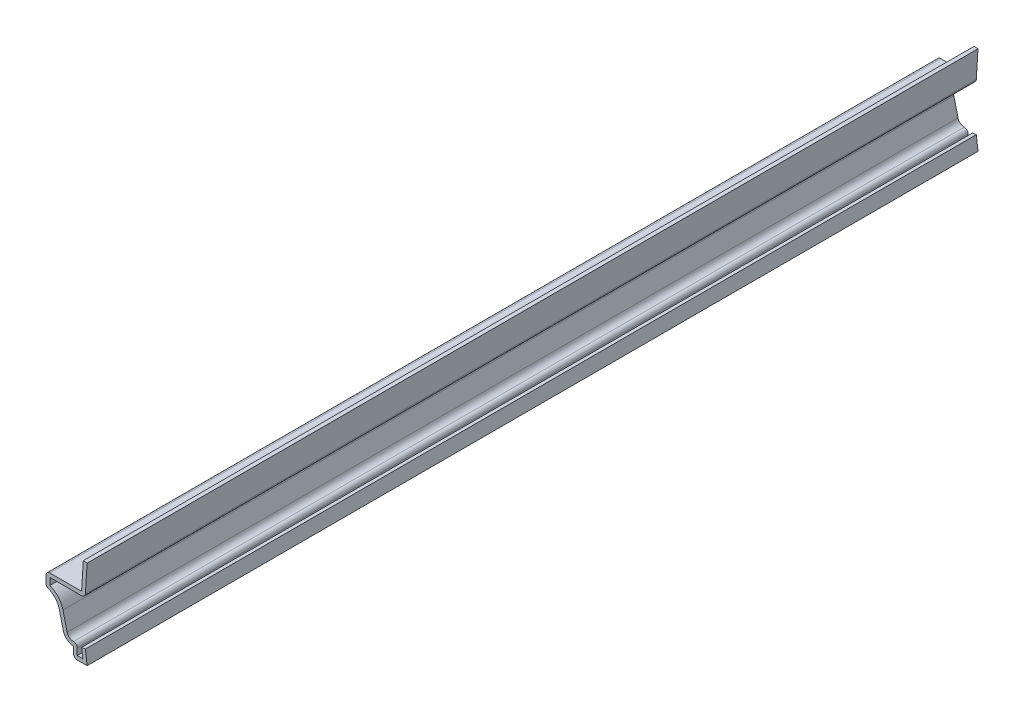
ISO-10303-21;
HEADER;
FILE_DESCRIPTION(('STEP AP214'),'2;1');
FILE_NAME('part.step','',(''),(''),'','','');
FILE_SCHEMA(('AUTOMOTIVE_DESIGN { 1 0 10303 214 1 1 1 1 }'));
ENDSEC;
DATA;
#1=APPLICATION_CONTEXT('core data for automotive mechanical design processes');
#2=APPLICATION_PROTOCOL_DEFINITION('international standard','automotive_design',2000,#1);
#3=PRODUCT_CONTEXT('',#1,'mechanical');
#4=PRODUCT('Part','Part','',(#3));
#5=PRODUCT_RELATED_PRODUCT_CATEGORY('part','',(#4));
#6=PRODUCT_DEFINITION_FORMATION('','',#4);
#7=PRODUCT_DEFINITION_CONTEXT('part definition',#1,'design');
#8=PRODUCT_DEFINITION('design','',#6,#7);
#9=PRODUCT_DEFINITION_SHAPE('','',#8);
#10=(LENGTH_UNIT() NAMED_UNIT(*) SI_UNIT(.MILLI.,.METRE.));
#11=(NAMED_UNIT(*) PLANE_ANGLE_UNIT() SI_UNIT($,.RADIAN.));
#12=(NAMED_UNIT(*) SI_UNIT($,.STERADIAN.) SOLID_ANGLE_UNIT());
#13=UNCERTAINTY_MEASURE_WITH_UNIT(LENGTH_MEASURE(1.E-05),#10,'distance_accuracy_value','');
#14=(GEOMETRIC_REPRESENTATION_CONTEXT(3) GLOBAL_UNCERTAINTY_ASSIGNED_CONTEXT((#13)) GLOBAL_UNIT_ASSIGNED_CONTEXT((#10,
#11,#12)) REPRESENTATION_CONTEXT('',''));
#15=CARTESIAN_POINT('',(0.,0.,0.));
#16=DIRECTION('',(0.,0.,1.));
#17=DIRECTION('',(1.,0.,0.));
#18=AXIS2_PLACEMENT_3D('',#15,#16,#17);
#19=CARTESIAN_POINT('',(0.,0.,-206.375));
#20=DIRECTION('',(0.992156741649221,0.125,0.));
#21=DIRECTION('',(-0.125,0.992156741649222,0.));
#22=AXIS2_PLACEMENT_3D('',#19,#20,#21);
#23=PLANE('',#22);
#24=DIRECTION('',(-0.125,0.992156741649221,0.));
#25=VECTOR('',#24,1.);
#26=CARTESIAN_POINT('',(0.,0.,0.));
#27=LINE('',#26,#25);
#28=CARTESIAN_POINT('',(0.,0.,0.));
#29=VERTEX_POINT('',#28);
#30=CARTESIAN_POINT('',(-0.396875,3.15009765473628,0.));
#31=VERTEX_POINT('',#30);
#32=EDGE_CURVE('E274',#29,#31,#27,.T.);
#33=ORIENTED_EDGE('',*,*,#32,.F.);
#34=DIRECTION('',(0.,0.,1.));
#35=VECTOR('',#34,1.);
#36=CARTESIAN_POINT('',(0.,0.,-206.375));
#37=LINE('',#36,#35);
#38=CARTESIAN_POINT('',(0.,0.,-206.375));
#39=VERTEX_POINT('',#38);
#40=EDGE_CURVE('E227',#39,#29,#37,.T.);
#41=ORIENTED_EDGE('',*,*,#40,.F.);
#42=DIRECTION('',(-0.125,0.992156741649221,0.));
#43=VECTOR('',#42,1.);
#44=CARTESIAN_POINT('',(0.,0.,-206.375));
#45=LINE('',#44,#43);
#46=CARTESIAN_POINT('',(-0.396875,3.15009765473628,-206.375));
#47=VERTEX_POINT('',#46);
#48=EDGE_CURVE('E207',#39,#47,#45,.T.);
#49=ORIENTED_EDGE('',*,*,#48,.T.);
#50=DIRECTION('',(0.,0.,1.));
#51=VECTOR('',#50,1.);
#52=CARTESIAN_POINT('',(-0.396875,3.15009765473628,-206.375));
#53=LINE('',#52,#51);
#54=EDGE_CURVE('E215',#47,#31,#53,.T.);
#55=ORIENTED_EDGE('',*,*,#54,.T.);
#56=EDGE_LOOP('',(#33,#41,#49,#55));
#57=FACE_BOUND('',#56,.T.);
#58=ADVANCED_FACE('F35',(#57),#23,.T.);
#59=CARTESIAN_POINT('',(-3.175,0.,-206.375));
#60=DIRECTION('',(0.,-1.,0.));
#61=DIRECTION('',(0.,0.,-1.));
#62=AXIS2_PLACEMENT_3D('',#59,#60,#61);
#63=PLANE('',#62);
#64=DIRECTION('',(1.,0.,0.));
#65=VECTOR('',#64,1.);
#66=CARTESIAN_POINT('',(-3.175,0.,0.));
#67=LINE('',#66,#65);
#68=CARTESIAN_POINT('',(-2.286,0.,0.));
#69=VERTEX_POINT('',#68);
#70=EDGE_CURVE('E228',#69,#29,#67,.T.);
#71=ORIENTED_EDGE('',*,*,#70,.F.);
#72=DIRECTION('',(0.,0.,1.));
#73=VECTOR('',#72,1.);
#74=CARTESIAN_POINT('',(-2.286,0.,-206.375));
#75=LINE('',#74,#73);
#76=CARTESIAN_POINT('',(-2.286,0.,-206.375));
#77=VERTEX_POINT('',#76);
#78=EDGE_CURVE('E364',#69,#77,#75,.F.);
#79=ORIENTED_EDGE('',*,*,#78,.T.);
#80=DIRECTION('',(1.,0.,0.));
#81=VECTOR('',#80,1.);
#82=CARTESIAN_POINT('',(-3.175,0.,-206.375));
#83=LINE('',#82,#81);
#84=EDGE_CURVE('E223',#77,#39,#83,.T.);
#85=ORIENTED_EDGE('',*,*,#84,.T.);
#86=ORIENTED_EDGE('',*,*,#40,.T.);
#87=EDGE_LOOP('',(#71,#79,#85,#86));
#88=FACE_BOUND('',#87,.T.);
#89=ADVANCED_FACE('F467',(#88),#63,.T.);
#90=CARTESIAN_POINT('',(-3.175,2.38125,-206.375));
#91=DIRECTION('',(-1.,0.,0.));
#92=DIRECTION('',(0.,0.,1.));
#93=AXIS2_PLACEMENT_3D('',#90,#91,#92);
#94=PLANE('',#93);
#95=DIRECTION('',(0.,-1.,0.));
#96=VECTOR('',#95,1.);
#97=CARTESIAN_POINT('',(-3.175,2.38125,-206.375));
#98=LINE('',#97,#96);
#99=CARTESIAN_POINT('',(-3.175,2.38125,-206.375));
#100=VERTEX_POINT('',#99);
#101=CARTESIAN_POINT('',(-3.175,0.889,-206.375));
#102=VERTEX_POINT('',#101);
#103=EDGE_CURVE('E270',#100,#102,#98,.T.);
#104=ORIENTED_EDGE('',*,*,#103,.T.);
#105=DIRECTION('',(0.,0.,1.));
#106=VECTOR('',#105,1.);
#107=CARTESIAN_POINT('',(-3.175,0.889,-206.375));
#108=LINE('',#107,#106);
#109=CARTESIAN_POINT('',(-3.175,0.889,0.));
#110=VERTEX_POINT('',#109);
#111=EDGE_CURVE('E318',#102,#110,#108,.T.);
#112=ORIENTED_EDGE('',*,*,#111,.T.);
#113=DIRECTION('',(0.,-1.,0.));
#114=VECTOR('',#113,1.);
#115=CARTESIAN_POINT('',(-3.175,2.38125,0.));
#116=LINE('',#115,#114);
#117=CARTESIAN_POINT('',(-3.175,2.38125,0.));
#118=VERTEX_POINT('',#117);
#119=EDGE_CURVE('E230',#118,#110,#116,.T.);
#120=ORIENTED_EDGE('',*,*,#119,.F.);
#121=DIRECTION('',(0.,0.,1.));
#122=VECTOR('',#121,1.);
#123=CARTESIAN_POINT('',(-3.175,2.38125,-206.375));
#124=LINE('',#123,#122);
#125=EDGE_CURVE('E319',#100,#118,#124,.T.);
#126=ORIENTED_EDGE('',*,*,#125,.F.);
#127=EDGE_LOOP('',(#104,#112,#120,#126));
#128=FACE_BOUND('',#127,.T.);
#129=ADVANCED_FACE('F459',(#128),#94,.T.);
#130=CARTESIAN_POINT('',(-3.175,4.7625,-206.375));
#131=DIRECTION('',(0.,0.,1.));
#132=DIRECTION('',(1.,0.,0.));
#133=AXIS2_PLACEMENT_3D('',#130,#131,#132);
#134=CYLINDRICAL_SURFACE('',#133,2.38125);
#135=CARTESIAN_POINT('',(-3.175,4.7625,0.));
#136=DIRECTION('',(0.,0.,1.));
#137=DIRECTION('',(1.,0.,0.));
#138=AXIS2_PLACEMENT_3D('',#135,#136,#137);
#139=CIRCLE('',#138,2.38125);
#140=CARTESIAN_POINT('',(-5.48745718700354,4.19426297130892,0.));
#141=VERTEX_POINT('',#140);
#142=EDGE_CURVE('E312',#141,#118,#139,.T.);
#143=ORIENTED_EDGE('',*,*,#142,.F.);
#144=DIRECTION('',(0.,0.,1.));
#145=VECTOR('',#144,1.);
#146=CARTESIAN_POINT('',(-5.48745718700354,4.19426297130892,-206.375));
#147=LINE('',#146,#145);
#148=CARTESIAN_POINT('',(-5.48745718700354,4.19426297130892,-206.375));
#149=VERTEX_POINT('',#148);
#150=EDGE_CURVE('E321',#149,#141,#147,.T.);
#151=ORIENTED_EDGE('',*,*,#150,.F.);
#152=CARTESIAN_POINT('',(-3.175,4.7625,-206.375));
#153=DIRECTION('',(0.,0.,1.));
#154=DIRECTION('',(1.,0.,0.));
#155=AXIS2_PLACEMENT_3D('',#152,#153,#154);
#156=CIRCLE('',#155,2.38125);
#157=EDGE_CURVE('E267',#149,#100,#156,.T.);
#158=ORIENTED_EDGE('',*,*,#157,.T.);
#159=ORIENTED_EDGE('',*,*,#125,.T.);
#160=EDGE_LOOP('',(#143,#151,#158,#159));
#161=FACE_BOUND('',#160,.T.);
#162=ADVANCED_FACE('F455',(#161),#134,.T.);
#163=CARTESIAN_POINT('',(-6.46465468832743,8.17099674781684,-206.375));
#164=DIRECTION('',(-0.971110629712773,-0.238629723334838,0.));
#165=DIRECTION('',(0.238629723334838,-0.971110629712773,0.));
#166=AXIS2_PLACEMENT_3D('',#163,#164,#165);
#167=PLANE('',#166);
#168=DIRECTION('',(0.238629723334838,-0.971110629712773,0.));
#169=VECTOR('',#168,1.);
#170=CARTESIAN_POINT('',(-6.46465468832743,8.17099674781684,0.));
#171=LINE('',#170,#169);
#172=CARTESIAN_POINT('',(-6.46465468832743,8.17099674781684,0.));
#173=VERTEX_POINT('',#172);
#174=EDGE_CURVE('E309',#173,#141,#171,.T.);
#175=ORIENTED_EDGE('',*,*,#174,.F.);
#176=DIRECTION('',(0.,0.,1.));
#177=VECTOR('',#176,1.);
#178=CARTESIAN_POINT('',(-6.46465468832743,8.17099674781684,-206.375));
#179=LINE('',#178,#177);
#180=CARTESIAN_POINT('',(-6.46465468832743,8.17099674781684,-206.375));
#181=VERTEX_POINT('',#180);
#182=EDGE_CURVE('E323',#181,#173,#179,.T.);
#183=ORIENTED_EDGE('',*,*,#182,.F.);
#184=DIRECTION('',(0.238629723334838,-0.971110629712773,0.));
#185=VECTOR('',#184,1.);
#186=CARTESIAN_POINT('',(-6.46465468832743,8.17099674781684,-206.375));
#187=LINE('',#186,#185);
#188=EDGE_CURVE('E264',#181,#149,#187,.T.);
#189=ORIENTED_EDGE('',*,*,#188,.T.);
#190=ORIENTED_EDGE('',*,*,#150,.T.);
#191=EDGE_LOOP('',(#175,#183,#189,#190));
#192=FACE_BOUND('',#191,.T.);
#193=ADVANCED_FACE('F451',(#192),#167,.T.);
#194=CARTESIAN_POINT('',(-10.31875,7.2239350333317,-206.375));
#195=DIRECTION('',(0.,0.,1.));
#196=DIRECTION('',(1.,0.,0.));
#197=AXIS2_PLACEMENT_3D('',#194,#195,#196);
#198=CYLINDRICAL_SURFACE('',#197,3.96875);
#199=CARTESIAN_POINT('',(-10.31875,7.2239350333317,0.));
#200=DIRECTION('',(0.,0.,-1.));
#201=DIRECTION('',(-1.,0.,0.));
#202=AXIS2_PLACEMENT_3D('',#199,#200,#201);
#203=CIRCLE('',#202,3.96875);
#204=CARTESIAN_POINT('',(-8.94395424836602,10.9469597718728,0.));
#205=VERTEX_POINT('',#204);
#206=EDGE_CURVE('E307',#205,#173,#203,.T.);
#207=ORIENTED_EDGE('',*,*,#206,.F.);
#208=DIRECTION('',(0.,0.,1.));
#209=VECTOR('',#208,1.);
#210=CARTESIAN_POINT('',(-8.94395424836602,10.9469597718728,-206.375));
#211=LINE('',#210,#209);
#212=CARTESIAN_POINT('',(-8.94395424836602,10.9469597718728,-206.375));
#213=VERTEX_POINT('',#212);
#214=EDGE_CURVE('E384',#205,#213,#211,.F.);
#215=ORIENTED_EDGE('',*,*,#214,.T.);
#216=CARTESIAN_POINT('',(-10.31875,7.2239350333317,-206.375));
#217=DIRECTION('',(0.,0.,-1.));
#218=DIRECTION('',(-1.,0.,0.));
#219=AXIS2_PLACEMENT_3D('',#216,#217,#218);
#220=CIRCLE('',#219,3.96875);
#221=EDGE_CURVE('E262',#213,#181,#220,.T.);
#222=ORIENTED_EDGE('',*,*,#221,.T.);
#223=ORIENTED_EDGE('',*,*,#182,.T.);
#224=EDGE_LOOP('',(#207,#215,#222,#223));
#225=FACE_BOUND('',#224,.T.);
#226=ADVANCED_FACE('F446',(#225),#198,.F.);
#227=CARTESIAN_POINT('',(-9.525,14.2875,-206.375));
#228=DIRECTION('',(-1.,0.,0.));
#229=DIRECTION('',(0.,-1.,0.));
#230=AXIS2_PLACEMENT_3D('',#227,#228,#229);
#231=PLANE('',#230);
#232=DIRECTION('',(0.,-1.,0.));
#233=VECTOR('',#232,1.);
#234=CARTESIAN_POINT('',(-9.525,14.2875,-206.375));
#235=LINE('',#234,#233);
#236=CARTESIAN_POINT('',(-9.525,13.3985,-206.375));
#237=VERTEX_POINT('',#236);
#238=CARTESIAN_POINT('',(-9.525,11.780917313306,-206.375));
#239=VERTEX_POINT('',#238);
#240=EDGE_CURVE('E259',#237,#239,#235,.T.);
#241=ORIENTED_EDGE('',*,*,#240,.T.);
#242=DIRECTION('',(0.,0.,1.));
#243=VECTOR('',#242,1.);
#244=CARTESIAN_POINT('',(-9.525,11.780917313306,-206.375));
#245=LINE('',#244,#243);
#246=CARTESIAN_POINT('',(-9.525,11.780917313306,0.));
#247=VERTEX_POINT('',#246);
#248=EDGE_CURVE('E381',#239,#247,#245,.T.);
#249=ORIENTED_EDGE('',*,*,#248,.T.);
#250=DIRECTION('',(0.,-1.,0.));
#251=VECTOR('',#250,1.);
#252=CARTESIAN_POINT('',(-9.525,14.2875,0.));
#253=LINE('',#252,#251);
#254=CARTESIAN_POINT('',(-9.525,13.3985,0.));
#255=VERTEX_POINT('',#254);
#256=EDGE_CURVE('E304',#255,#247,#253,.T.);
#257=ORIENTED_EDGE('',*,*,#256,.F.);
#258=DIRECTION('',(0.,0.,1.));
#259=VECTOR('',#258,1.);
#260=CARTESIAN_POINT('',(-9.525,13.3985,-206.375));
#261=LINE('',#260,#259);
#262=EDGE_CURVE('E379',#255,#237,#261,.F.);
#263=ORIENTED_EDGE('',*,*,#262,.T.);
#264=EDGE_LOOP('',(#241,#249,#257,#263));
#265=FACE_BOUND('',#264,.T.);
#266=ADVANCED_FACE('F434',(#265),#231,.T.);
#267=CARTESIAN_POINT('',(-1.28414374227129,14.2875,-206.375));
#268=DIRECTION('',(0.,1.,0.));
#269=DIRECTION('',(0.,0.,1.));
#270=AXIS2_PLACEMENT_3D('',#267,#268,#269);
#271=PLANE('',#270);
#272=DIRECTION('',(-1.,0.,0.));
#273=VECTOR('',#272,1.);
#274=CARTESIAN_POINT('',(-1.28414374227129,14.2875,-206.375));
#275=LINE('',#274,#273);
#276=CARTESIAN_POINT('',(-1.28414374227129,14.2875,-206.375));
#277=VERTEX_POINT('',#276);
#278=CARTESIAN_POINT('',(-8.636,14.2875,-206.375));
#279=VERTEX_POINT('',#278);
#280=EDGE_CURVE('E256',#277,#279,#275,.T.);
#281=ORIENTED_EDGE('',*,*,#280,.T.);
#282=DIRECTION('',(0.,0.,1.));
#283=VECTOR('',#282,1.);
#284=CARTESIAN_POINT('',(-8.636,14.2875,-206.375));
#285=LINE('',#284,#283);
#286=CARTESIAN_POINT('',(-8.636,14.2875,0.));
#287=VERTEX_POINT('',#286);
#288=EDGE_CURVE('E386',#279,#287,#285,.T.);
#289=ORIENTED_EDGE('',*,*,#288,.T.);
#290=DIRECTION('',(-1.,0.,0.));
#291=VECTOR('',#290,1.);
#292=CARTESIAN_POINT('',(-1.28414374227129,14.2875,0.));
#293=LINE('',#292,#291);
#294=CARTESIAN_POINT('',(-1.28414374227129,14.2875,0.));
#295=VERTEX_POINT('',#294);
#296=EDGE_CURVE('E301',#295,#287,#293,.T.);
#297=ORIENTED_EDGE('',*,*,#296,.F.);
#298=DIRECTION('',(0.,0.,1.));
#299=VECTOR('',#298,1.);
#300=CARTESIAN_POINT('',(-1.28414374227129,14.2875,-206.375));
#301=LINE('',#300,#299);
#302=EDGE_CURVE('E326',#277,#295,#301,.T.);
#303=ORIENTED_EDGE('',*,*,#302,.F.);
#304=EDGE_LOOP('',(#281,#289,#297,#303));
#305=FACE_BOUND('',#304,.T.);
#306=ADVANCED_FACE('F428',(#305),#271,.T.);
#307=CARTESIAN_POINT('',(-0.887268742271285,20.6375,-206.375));
#308=DIRECTION('',(-0.998052578482889,0.0623782861551807,0.));
#309=DIRECTION('',(-0.0623782861551807,-0.998052578482889,0.));
#310=AXIS2_PLACEMENT_3D('',#307,#308,#309);
#311=PLANE('',#310);
#312=DIRECTION('',(-0.0623782861551807,-0.998052578482889,0.));
#313=VECTOR('',#312,1.);
#314=CARTESIAN_POINT('',(-0.887268742271285,20.6375,0.));
#315=LINE('',#314,#313);
#316=CARTESIAN_POINT('',(-0.887268742271285,20.6375,0.));
#317=VERTEX_POINT('',#316);
#318=EDGE_CURVE('E298',#317,#295,#315,.T.);
#319=ORIENTED_EDGE('',*,*,#318,.F.);
#320=DIRECTION('',(0.,0.,1.));
#321=VECTOR('',#320,1.);
#322=CARTESIAN_POINT('',(-0.887268742271285,20.6375,-206.375));
#323=LINE('',#322,#321);
#324=CARTESIAN_POINT('',(-0.887268742271285,20.6375,-206.375));
#325=VERTEX_POINT('',#324);
#326=EDGE_CURVE('E328',#325,#317,#323,.T.);
#327=ORIENTED_EDGE('',*,*,#326,.F.);
#328=DIRECTION('',(-0.0623782861551807,-0.998052578482889,0.));
#329=VECTOR('',#328,1.);
#330=CARTESIAN_POINT('',(-0.887268742271285,20.6375,-206.375));
#331=LINE('',#330,#329);
#332=EDGE_CURVE('E253',#325,#277,#331,.T.);
#333=ORIENTED_EDGE('',*,*,#332,.T.);
#334=ORIENTED_EDGE('',*,*,#302,.T.);
#335=EDGE_LOOP('',(#319,#327,#333,#334));
#336=FACE_BOUND('',#335,.T.);
#337=ADVANCED_FACE('F422',(#336),#311,.T.);
#338=CARTESIAN_POINT('',(-0.887268742271285,20.6375,-206.375));
#339=DIRECTION('',(-0.0623782861551812,-0.998052578482889,0.));
#340=DIRECTION('',(0.998052578482889,-0.0623782861551812,0.));
#341=AXIS2_PLACEMENT_3D('',#338,#339,#340);
#342=PLANE('',#341);
#343=DIRECTION('',(0.998052578482889,-0.0623782861551811,0.));
#344=VECTOR('',#343,1.);
#345=CARTESIAN_POINT('',(-0.887268742271285,20.6375,0.));
#346=LINE('',#345,#344);
#347=CARTESIAN_POINT('',(0.,20.582045703608,0.));
#348=VERTEX_POINT('',#347);
#349=EDGE_CURVE('E296',#317,#348,#346,.T.);
#350=ORIENTED_EDGE('',*,*,#349,.T.);
#351=DIRECTION('',(0.,0.,1.));
#352=VECTOR('',#351,1.);
#353=CARTESIAN_POINT('',(0.,20.582045703608,-206.375));
#354=LINE('',#353,#352);
#355=CARTESIAN_POINT('',(0.,20.582045703608,-206.375));
#356=VERTEX_POINT('',#355);
#357=EDGE_CURVE('E330',#356,#348,#354,.T.);
#358=ORIENTED_EDGE('',*,*,#357,.F.);
#359=DIRECTION('',(0.998052578482889,-0.0623782861551811,0.));
#360=VECTOR('',#359,1.);
#361=CARTESIAN_POINT('',(-0.887268742271285,20.6375,-206.375));
#362=LINE('',#361,#360);
#363=EDGE_CURVE('E251',#325,#356,#362,.T.);
#364=ORIENTED_EDGE('',*,*,#363,.F.);
#365=ORIENTED_EDGE('',*,*,#326,.T.);
#366=EDGE_LOOP('',(#350,#358,#364,#365));
#367=FACE_BOUND('',#366,.T.);
#368=ADVANCED_FACE('F522',(#367),#342,.F.);
#369=CARTESIAN_POINT('',(0.,20.582045703608,-206.375));
#370=DIRECTION('',(-0.998052578482889,0.0623782861551807,0.));
#371=DIRECTION('',(-0.0623782861551807,-0.998052578482889,0.));
#372=AXIS2_PLACEMENT_3D('',#369,#370,#371);
#373=PLANE('',#372);
#374=DIRECTION('',(-0.0623782861551807,-0.998052578482889,0.));
#375=VECTOR('',#374,1.);
#376=CARTESIAN_POINT('',(0.,20.582045703608,0.));
#377=LINE('',#376,#375);
#378=CARTESIAN_POINT('',(-0.396874999999999,14.232045703608,0.));
#379=VERTEX_POINT('',#378);
#380=EDGE_CURVE('E293',#348,#379,#377,.T.);
#381=ORIENTED_EDGE('',*,*,#380,.T.);
#382=DIRECTION('',(0.,0.,1.));
#383=VECTOR('',#382,1.);
#384=CARTESIAN_POINT('',(-0.396874999999999,14.232045703608,-206.375));
#385=LINE('',#384,#383);
#386=CARTESIAN_POINT('',(-0.396874999999999,14.232045703608,-206.375));
#387=VERTEX_POINT('',#386);
#388=EDGE_CURVE('E11',#379,#387,#385,.F.);
#389=ORIENTED_EDGE('',*,*,#388,.T.);
#390=DIRECTION('',(-0.0623782861551807,-0.998052578482889,0.));
#391=VECTOR('',#390,1.);
#392=CARTESIAN_POINT('',(0.,20.582045703608,-206.375));
#393=LINE('',#392,#391);
#394=EDGE_CURVE('E248',#356,#387,#393,.T.);
#395=ORIENTED_EDGE('',*,*,#394,.F.);
#396=ORIENTED_EDGE('',*,*,#357,.T.);
#397=EDGE_LOOP('',(#381,#389,#395,#396));
#398=FACE_BOUND('',#397,.T.);
#399=ADVANCED_FACE('F416',(#398),#373,.F.);
#400=CARTESIAN_POINT('',(-1.28414374227129,13.3985,-206.375));
#401=DIRECTION('',(0.,1.,0.));
#402=DIRECTION('',(0.,0.,1.));
#403=AXIS2_PLACEMENT_3D('',#400,#401,#402);
#404=PLANE('',#403);
#405=DIRECTION('',(1.,0.,0.));
#406=VECTOR('',#405,1.);
#407=CARTESIAN_POINT('',(-1.28414374227129,13.3985,-206.375));
#408=LINE('',#407,#406);
#409=CARTESIAN_POINT('',(-1.28414374227129,13.3985,-206.375));
#410=VERTEX_POINT('',#409);
#411=CARTESIAN_POINT('',(-8.636,13.3985,-206.375));
#412=VERTEX_POINT('',#411);
#413=EDGE_CURVE('E246',#410,#412,#408,.F.);
#414=ORIENTED_EDGE('',*,*,#413,.F.);
#415=DIRECTION('',(0.,0.,1.));
#416=VECTOR('',#415,1.);
#417=CARTESIAN_POINT('',(-1.28414374227129,13.3985,-206.375));
#418=LINE('',#417,#416);
#419=CARTESIAN_POINT('',(-1.28414374227129,13.3985,0.));
#420=VERTEX_POINT('',#419);
#421=EDGE_CURVE('E43',#410,#420,#418,.T.);
#422=ORIENTED_EDGE('',*,*,#421,.T.);
#423=DIRECTION('',(1.,0.,0.));
#424=VECTOR('',#423,1.);
#425=CARTESIAN_POINT('',(-1.28414374227129,13.3985,0.));
#426=LINE('',#425,#424);
#427=CARTESIAN_POINT('',(-8.636,13.3985,0.));
#428=VERTEX_POINT('',#427);
#429=EDGE_CURVE('E291',#420,#428,#426,.F.);
#430=ORIENTED_EDGE('',*,*,#429,.T.);
#431=DIRECTION('',(0.,0.,1.));
#432=VECTOR('',#431,1.);
#433=CARTESIAN_POINT('',(-8.636,13.3985,-206.375));
#434=LINE('',#433,#432);
#435=EDGE_CURVE('E333',#412,#428,#434,.T.);
#436=ORIENTED_EDGE('',*,*,#435,.F.);
#437=EDGE_LOOP('',(#414,#422,#430,#436));
#438=FACE_BOUND('',#437,.T.);
#439=ADVANCED_FACE('F393',(#438),#404,.F.);
#440=CARTESIAN_POINT('',(-8.636,14.2875,-206.375));
#441=DIRECTION('',(-1.,0.,0.));
#442=DIRECTION('',(0.,-1.,0.));
#443=AXIS2_PLACEMENT_3D('',#440,#441,#442);
#444=PLANE('',#443);
#445=DIRECTION('',(0.,-1.,0.));
#446=VECTOR('',#445,1.);
#447=CARTESIAN_POINT('',(-8.636,14.2875,0.));
#448=LINE('',#447,#446);
#449=CARTESIAN_POINT('',(-8.636,11.780917313306,0.));
#450=VERTEX_POINT('',#449);
#451=EDGE_CURVE('E289',#428,#450,#448,.T.);
#452=ORIENTED_EDGE('',*,*,#451,.T.);
#453=DIRECTION('',(0.,0.,1.));
#454=VECTOR('',#453,1.);
#455=CARTESIAN_POINT('',(-8.636,11.780917313306,-206.375));
#456=LINE('',#455,#454);
#457=CARTESIAN_POINT('',(-8.636,11.780917313306,-206.375));
#458=VERTEX_POINT('',#457);
#459=EDGE_CURVE('E336',#458,#450,#456,.T.);
#460=ORIENTED_EDGE('',*,*,#459,.F.);
#461=DIRECTION('',(0.,-1.,0.));
#462=VECTOR('',#461,1.);
#463=CARTESIAN_POINT('',(-8.636,14.2875,-206.375));
#464=LINE('',#463,#462);
#465=EDGE_CURVE('E244',#412,#458,#464,.T.);
#466=ORIENTED_EDGE('',*,*,#465,.F.);
#467=ORIENTED_EDGE('',*,*,#435,.T.);
#468=EDGE_LOOP('',(#452,#460,#466,#467));
#469=FACE_BOUND('',#468,.T.);
#470=ADVANCED_FACE('F405',(#469),#444,.F.);
#471=CARTESIAN_POINT('',(-10.31875,7.2239350333317,-206.375));
#472=DIRECTION('',(0.,0.,1.));
#473=DIRECTION('',(1.,0.,0.));
#474=AXIS2_PLACEMENT_3D('',#471,#472,#473);
#475=CYLINDRICAL_SURFACE('',#474,4.85775);
#476=CARTESIAN_POINT('',(-10.31875,7.2239350333317,0.));
#477=DIRECTION('',(0.,0.,1.));
#478=DIRECTION('',(1.,0.,0.));
#479=AXIS2_PLACEMENT_3D('',#476,#477,#478);
#480=CIRCLE('',#479,4.85775);
#481=CARTESIAN_POINT('',(-5.60133733851278,8.38313857186151,0.));
#482=VERTEX_POINT('',#481);
#483=EDGE_CURVE('E287',#450,#482,#480,.F.);
#484=ORIENTED_EDGE('',*,*,#483,.T.);
#485=DIRECTION('',(0.,0.,1.));
#486=VECTOR('',#485,1.);
#487=CARTESIAN_POINT('',(-5.60133733851278,8.38313857186151,-206.375));
#488=LINE('',#487,#486);
#489=CARTESIAN_POINT('',(-5.60133733851278,8.38313857186151,-206.375));
#490=VERTEX_POINT('',#489);
#491=EDGE_CURVE('E339',#490,#482,#488,.T.);
#492=ORIENTED_EDGE('',*,*,#491,.F.);
#493=CARTESIAN_POINT('',(-10.31875,7.2239350333317,-206.375));
#494=DIRECTION('',(0.,0.,1.));
#495=DIRECTION('',(1.,0.,0.));
#496=AXIS2_PLACEMENT_3D('',#493,#494,#495);
#497=CIRCLE('',#496,4.85775);
#498=EDGE_CURVE('E242',#458,#490,#497,.F.);
#499=ORIENTED_EDGE('',*,*,#498,.F.);
#500=ORIENTED_EDGE('',*,*,#459,.T.);
#501=EDGE_LOOP('',(#484,#492,#499,#500));
#502=FACE_BOUND('',#501,.T.);
#503=ADVANCED_FACE('F409',(#502),#475,.T.);
#504=CARTESIAN_POINT('',(-5.60133733851278,8.38313857186151,-206.375));
#505=DIRECTION('',(-0.971110629712773,-0.238629723334838,0.));
#506=DIRECTION('',(0.238629723334838,-0.971110629712773,0.));
#507=AXIS2_PLACEMENT_3D('',#504,#505,#506);
#508=PLANE('',#507);
#509=DIRECTION('',(0.238629723334838,-0.971110629712773,0.));
#510=VECTOR('',#509,1.);
#511=CARTESIAN_POINT('',(-5.60133733851278,8.38313857186151,0.));
#512=LINE('',#511,#510);
#513=CARTESIAN_POINT('',(-4.62413983718889,4.40640479535359,0.));
#514=VERTEX_POINT('',#513);
#515=EDGE_CURVE('E285',#482,#514,#512,.T.);
#516=ORIENTED_EDGE('',*,*,#515,.T.);
#517=DIRECTION('',(0.,0.,1.));
#518=VECTOR('',#517,1.);
#519=CARTESIAN_POINT('',(-4.62413983718889,4.40640479535359,-206.375));
#520=LINE('',#519,#518);
#521=CARTESIAN_POINT('',(-4.62413983718889,4.40640479535359,-206.375));
#522=VERTEX_POINT('',#521);
#523=EDGE_CURVE('E342',#522,#514,#520,.T.);
#524=ORIENTED_EDGE('',*,*,#523,.F.);
#525=DIRECTION('',(0.238629723334838,-0.971110629712773,0.));
#526=VECTOR('',#525,1.);
#527=CARTESIAN_POINT('',(-5.60133733851278,8.38313857186151,-206.375));
#528=LINE('',#527,#526);
#529=EDGE_CURVE('E240',#490,#522,#528,.T.);
#530=ORIENTED_EDGE('',*,*,#529,.F.);
#531=ORIENTED_EDGE('',*,*,#491,.T.);
#532=EDGE_LOOP('',(#516,#524,#530,#531));
#533=FACE_BOUND('',#532,.T.);
#534=ADVANCED_FACE('F510',(#533),#508,.F.);
#535=CARTESIAN_POINT('',(-3.175,4.7625,-206.375));
#536=DIRECTION('',(0.,0.,1.));
#537=DIRECTION('',(1.,0.,0.));
#538=AXIS2_PLACEMENT_3D('',#535,#536,#537);
#539=CYLINDRICAL_SURFACE('',#538,1.49225);
#540=CARTESIAN_POINT('',(-3.175,4.7625,0.));
#541=DIRECTION('',(0.,0.,1.));
#542=DIRECTION('',(1.,0.,0.));
#543=AXIS2_PLACEMENT_3D('',#540,#541,#542);
#544=CIRCLE('',#543,1.49225);
#545=CARTESIAN_POINT('',(-3.175,3.27025,0.));
#546=VERTEX_POINT('',#545);
#547=EDGE_CURVE('E283',#514,#546,#544,.T.);
#548=ORIENTED_EDGE('',*,*,#547,.T.);
#549=DIRECTION('',(0.,0.,1.));
#550=VECTOR('',#549,1.);
#551=CARTESIAN_POINT('',(-3.175,3.27025,-206.375));
#552=LINE('',#551,#550);
#553=CARTESIAN_POINT('',(-3.175,3.27025,-206.375));
#554=VERTEX_POINT('',#553);
#555=EDGE_CURVE('E58',#546,#554,#552,.F.);
#556=ORIENTED_EDGE('',*,*,#555,.T.);
#557=CARTESIAN_POINT('',(-3.175,4.7625,-206.375));
#558=DIRECTION('',(0.,0.,1.));
#559=DIRECTION('',(1.,0.,0.));
#560=AXIS2_PLACEMENT_3D('',#557,#558,#559);
#561=CIRCLE('',#560,1.49225);
#562=EDGE_CURVE('E238',#522,#554,#561,.T.);
#563=ORIENTED_EDGE('',*,*,#562,.F.);
#564=ORIENTED_EDGE('',*,*,#523,.T.);
#565=EDGE_LOOP('',(#548,#556,#563,#564));
#566=FACE_BOUND('',#565,.T.);
#567=ADVANCED_FACE('F483',(#566),#539,.F.);
#568=CARTESIAN_POINT('',(-2.286,2.38125,-206.375));
#569=DIRECTION('',(-1.,0.,0.));
#570=DIRECTION('',(0.,0.,1.));
#571=AXIS2_PLACEMENT_3D('',#568,#569,#570);
#572=PLANE('',#571);
#573=DIRECTION('',(0.,1.,0.));
#574=VECTOR('',#573,1.);
#575=CARTESIAN_POINT('',(-2.286,2.38125,-206.375));
#576=LINE('',#575,#574);
#577=CARTESIAN_POINT('',(-2.286,2.38125,-206.375));
#578=VERTEX_POINT('',#577);
#579=CARTESIAN_POINT('',(-2.286,0.889,-206.375));
#580=VERTEX_POINT('',#579);
#581=EDGE_CURVE('E236',#578,#580,#576,.F.);
#582=ORIENTED_EDGE('',*,*,#581,.F.);
#583=DIRECTION('',(0.,0.,1.));
#584=VECTOR('',#583,1.);
#585=CARTESIAN_POINT('',(-2.286,2.38125,-206.375));
#586=LINE('',#585,#584);
#587=CARTESIAN_POINT('',(-2.286,2.38125,0.));
#588=VERTEX_POINT('',#587);
#589=EDGE_CURVE('E375',#578,#588,#586,.T.);
#590=ORIENTED_EDGE('',*,*,#589,.T.);
#591=DIRECTION('',(0.,1.,0.));
#592=VECTOR('',#591,1.);
#593=CARTESIAN_POINT('',(-2.286,2.38125,0.));
#594=LINE('',#593,#592);
#595=CARTESIAN_POINT('',(-2.286,0.889,0.));
#596=VERTEX_POINT('',#595);
#597=EDGE_CURVE('E281',#588,#596,#594,.F.);
#598=ORIENTED_EDGE('',*,*,#597,.T.);
#599=DIRECTION('',(0.,0.,1.));
#600=VECTOR('',#599,1.);
#601=CARTESIAN_POINT('',(-2.286,0.889,-206.375));
#602=LINE('',#601,#600);
#603=EDGE_CURVE('E345',#580,#596,#602,.T.);
#604=ORIENTED_EDGE('',*,*,#603,.F.);
#605=EDGE_LOOP('',(#582,#590,#598,#604));
#606=FACE_BOUND('',#605,.T.);
#607=ADVANCED_FACE('F479',(#606),#572,.F.);
#608=CARTESIAN_POINT('',(-3.175,0.889,-206.375));
#609=DIRECTION('',(0.,-1.,0.));
#610=DIRECTION('',(0.,0.,-1.));
#611=AXIS2_PLACEMENT_3D('',#608,#609,#610);
#612=PLANE('',#611);
#613=DIRECTION('',(1.,0.,0.));
#614=VECTOR('',#613,1.);
#615=CARTESIAN_POINT('',(-3.175,0.889,0.));
#616=LINE('',#615,#614);
#617=CARTESIAN_POINT('',(-1.00803124951561,0.889,0.));
#618=VERTEX_POINT('',#617);
#619=EDGE_CURVE('E279',#596,#618,#616,.T.);
#620=ORIENTED_EDGE('',*,*,#619,.T.);
#621=DIRECTION('',(0.,0.,1.));
#622=VECTOR('',#621,1.);
#623=CARTESIAN_POINT('',(-1.00803124951561,0.889,-206.375));
#624=LINE('',#623,#622);
#625=CARTESIAN_POINT('',(-1.00803124951561,0.889,-206.375));
#626=VERTEX_POINT('',#625);
#627=EDGE_CURVE('E348',#626,#618,#624,.T.);
#628=ORIENTED_EDGE('',*,*,#627,.F.);
#629=DIRECTION('',(1.,0.,0.));
#630=VECTOR('',#629,1.);
#631=CARTESIAN_POINT('',(-3.175,0.889,-206.375));
#632=LINE('',#631,#630);
#633=EDGE_CURVE('E234',#580,#626,#632,.T.);
#634=ORIENTED_EDGE('',*,*,#633,.F.);
#635=ORIENTED_EDGE('',*,*,#603,.T.);
#636=EDGE_LOOP('',(#620,#628,#634,#635));
#637=FACE_BOUND('',#636,.T.);
#638=ADVANCED_FACE('F476',(#637),#612,.F.);
#639=CARTESIAN_POINT('',(-0.882027343326158,-0.111125,-206.375));
#640=DIRECTION('',(0.992156741649222,0.125,0.));
#641=DIRECTION('',(-0.125,0.992156741649222,0.));
#642=AXIS2_PLACEMENT_3D('',#639,#640,#641);
#643=PLANE('',#642);
#644=DIRECTION('',(-0.125,0.992156741649222,0.));
#645=VECTOR('',#644,1.);
#646=CARTESIAN_POINT('',(-0.882027343326158,-0.111125,0.));
#647=LINE('',#646,#645);
#648=CARTESIAN_POINT('',(-1.27890234332616,3.03897265473628,0.));
#649=VERTEX_POINT('',#648);
#650=EDGE_CURVE('E277',#618,#649,#647,.T.);
#651=ORIENTED_EDGE('',*,*,#650,.T.);
#652=DIRECTION('',(0.,0.,1.));
#653=VECTOR('',#652,1.);
#654=CARTESIAN_POINT('',(-1.27890234332616,3.03897265473628,-206.375));
#655=LINE('',#654,#653);
#656=CARTESIAN_POINT('',(-1.27890234332616,3.03897265473628,-206.375));
#657=VERTEX_POINT('',#656);
#658=EDGE_CURVE('E222',#657,#649,#655,.T.);
#659=ORIENTED_EDGE('',*,*,#658,.F.);
#660=DIRECTION('',(-0.125,0.992156741649222,0.));
#661=VECTOR('',#660,1.);
#662=CARTESIAN_POINT('',(-0.882027343326158,-0.111125,-206.375));
#663=LINE('',#662,#661);
#664=EDGE_CURVE('E209',#626,#657,#663,.T.);
#665=ORIENTED_EDGE('',*,*,#664,.F.);
#666=ORIENTED_EDGE('',*,*,#627,.T.);
#667=EDGE_LOOP('',(#651,#659,#665,#666));
#668=FACE_BOUND('',#667,.T.);
#669=ADVANCED_FACE('F472',(#668),#643,.F.);
#670=CARTESIAN_POINT('',(-1.27890234332616,3.03897265473628,-206.375));
#671=DIRECTION('',(0.124999999999999,-0.992156741649222,0.));
#672=DIRECTION('',(0.992156741649222,0.124999999999999,0.));
#673=AXIS2_PLACEMENT_3D('',#670,#671,#672);
#674=PLANE('',#673);
#675=DIRECTION('',(0.992156741649222,0.124999999999999,0.));
#676=VECTOR('',#675,1.);
#677=CARTESIAN_POINT('',(-1.27890234332616,3.03897265473628,0.));
#678=LINE('',#677,#676);
#679=EDGE_CURVE('E218',#649,#31,#678,.T.);
#680=ORIENTED_EDGE('',*,*,#679,.T.);
#681=ORIENTED_EDGE('',*,*,#54,.F.);
#682=DIRECTION('',(0.992156741649222,0.124999999999999,0.));
#683=VECTOR('',#682,1.);
#684=CARTESIAN_POINT('',(-1.27890234332616,3.03897265473628,-206.375));
#685=LINE('',#684,#683);
#686=EDGE_CURVE('E202',#657,#47,#685,.T.);
#687=ORIENTED_EDGE('',*,*,#686,.F.);
#688=ORIENTED_EDGE('',*,*,#658,.T.);
#689=EDGE_LOOP('',(#680,#681,#687,#688));
#690=FACE_BOUND('',#689,.T.);
#691=ADVANCED_FACE('F216',(#690),#674,.F.);
#692=CARTESIAN_POINT('',(-3.175,4.7625,-206.375));
#693=DIRECTION('',(0.,0.,1.));
#694=DIRECTION('',(1.,0.,0.));
#695=AXIS2_PLACEMENT_3D('',#692,#693,#694);
#696=PLANE('',#695);
#697=ORIENTED_EDGE('',*,*,#84,.F.);
#698=CARTESIAN_POINT('',(-2.286,0.889,-206.375));
#699=DIRECTION('',(0.,0.,1.));
#700=DIRECTION('',(1.,0.,0.));
#701=AXIS2_PLACEMENT_3D('',#698,#699,#700);
#702=CIRCLE('',#701,0.889);
#703=EDGE_CURVE('E373',#77,#102,#702,.F.);
#704=ORIENTED_EDGE('',*,*,#703,.T.);
#705=ORIENTED_EDGE('',*,*,#103,.F.);
#706=ORIENTED_EDGE('',*,*,#157,.F.);
#707=ORIENTED_EDGE('',*,*,#188,.F.);
#708=ORIENTED_EDGE('',*,*,#221,.F.);
#709=CARTESIAN_POINT('',(-8.636,11.780917313306,-206.375));
#710=DIRECTION('',(0.,0.,1.));
#711=DIRECTION('',(1.,0.,0.));
#712=AXIS2_PLACEMENT_3D('',#709,#710,#711);
#713=CIRCLE('',#712,0.889);
#714=EDGE_CURVE('E370',#213,#239,#713,.F.);
#715=ORIENTED_EDGE('',*,*,#714,.T.);
#716=ORIENTED_EDGE('',*,*,#240,.F.);
#717=CARTESIAN_POINT('',(-8.636,13.3985,-206.375));
#718=DIRECTION('',(0.,0.,1.));
#719=DIRECTION('',(1.,0.,0.));
#720=AXIS2_PLACEMENT_3D('',#717,#718,#719);
#721=CIRCLE('',#720,0.889);
#722=EDGE_CURVE('E368',#237,#279,#721,.F.);
#723=ORIENTED_EDGE('',*,*,#722,.T.);
#724=ORIENTED_EDGE('',*,*,#280,.F.);
#725=ORIENTED_EDGE('',*,*,#332,.F.);
#726=ORIENTED_EDGE('',*,*,#363,.T.);
#727=ORIENTED_EDGE('',*,*,#394,.T.);
#728=CARTESIAN_POINT('',(-1.28414374227129,14.2875,-206.375));
#729=DIRECTION('',(0.,0.,1.));
#730=DIRECTION('',(1.,0.,0.));
#731=AXIS2_PLACEMENT_3D('',#728,#729,#730);
#732=CIRCLE('',#731,0.889);
#733=EDGE_CURVE('E366',#387,#410,#732,.F.);
#734=ORIENTED_EDGE('',*,*,#733,.T.);
#735=ORIENTED_EDGE('',*,*,#413,.T.);
#736=ORIENTED_EDGE('',*,*,#465,.T.);
#737=ORIENTED_EDGE('',*,*,#498,.T.);
#738=ORIENTED_EDGE('',*,*,#529,.T.);
#739=ORIENTED_EDGE('',*,*,#562,.T.);
#740=CARTESIAN_POINT('',(-3.175,2.38125,-206.375));
#741=DIRECTION('',(0.,0.,1.));
#742=DIRECTION('',(1.,0.,0.));
#743=AXIS2_PLACEMENT_3D('',#740,#741,#742);
#744=CIRCLE('',#743,0.889);
#745=EDGE_CURVE('E50',#554,#578,#744,.F.);
#746=ORIENTED_EDGE('',*,*,#745,.T.);
#747=ORIENTED_EDGE('',*,*,#581,.T.);
#748=ORIENTED_EDGE('',*,*,#633,.T.);
#749=ORIENTED_EDGE('',*,*,#664,.T.);
#750=ORIENTED_EDGE('',*,*,#686,.T.);
#751=ORIENTED_EDGE('',*,*,#48,.F.);
#752=EDGE_LOOP('',(#697,#704,#705,#706,#707,#708,#715,#716,#723,#724,#725,#726,#727,#734,#735,
#736,#737,#738,#739,#746,#747,#748,#749,#750,#751));
#753=FACE_BOUND('',#752,.T.);
#754=ADVANCED_FACE('F205',(#753),#696,.F.);
#755=CARTESIAN_POINT('',(-3.175,4.7625,0.));
#756=DIRECTION('',(0.,0.,1.));
#757=DIRECTION('',(1.,0.,0.));
#758=AXIS2_PLACEMENT_3D('',#755,#756,#757);
#759=PLANE('',#758);
#760=ORIENTED_EDGE('',*,*,#119,.T.);
#761=CARTESIAN_POINT('',(-2.286,0.889,0.));
#762=DIRECTION('',(0.,0.,1.));
#763=DIRECTION('',(1.,0.,0.));
#764=AXIS2_PLACEMENT_3D('',#761,#762,#763);
#765=CIRCLE('',#764,0.889);
#766=EDGE_CURVE('E362',#110,#69,#765,.T.);
#767=ORIENTED_EDGE('',*,*,#766,.T.);
#768=ORIENTED_EDGE('',*,*,#70,.T.);
#769=ORIENTED_EDGE('',*,*,#32,.T.);
#770=ORIENTED_EDGE('',*,*,#679,.F.);
#771=ORIENTED_EDGE('',*,*,#650,.F.);
#772=ORIENTED_EDGE('',*,*,#619,.F.);
#773=ORIENTED_EDGE('',*,*,#597,.F.);
#774=CARTESIAN_POINT('',(-3.175,2.38125,0.));
#775=DIRECTION('',(0.,0.,1.));
#776=DIRECTION('',(1.,0.,0.));
#777=AXIS2_PLACEMENT_3D('',#774,#775,#776);
#778=CIRCLE('',#777,0.889);
#779=EDGE_CURVE('E360',#588,#546,#778,.T.);
#780=ORIENTED_EDGE('',*,*,#779,.T.);
#781=ORIENTED_EDGE('',*,*,#547,.F.);
#782=ORIENTED_EDGE('',*,*,#515,.F.);
#783=ORIENTED_EDGE('',*,*,#483,.F.);
#784=ORIENTED_EDGE('',*,*,#451,.F.);
#785=ORIENTED_EDGE('',*,*,#429,.F.);
#786=CARTESIAN_POINT('',(-1.28414374227129,14.2875,0.));
#787=DIRECTION('',(0.,0.,1.));
#788=DIRECTION('',(1.,0.,0.));
#789=AXIS2_PLACEMENT_3D('',#786,#787,#788);
#790=CIRCLE('',#789,0.889);
#791=EDGE_CURVE('E354',#420,#379,#790,.T.);
#792=ORIENTED_EDGE('',*,*,#791,.T.);
#793=ORIENTED_EDGE('',*,*,#380,.F.);
#794=ORIENTED_EDGE('',*,*,#349,.F.);
#795=ORIENTED_EDGE('',*,*,#318,.T.);
#796=ORIENTED_EDGE('',*,*,#296,.T.);
#797=CARTESIAN_POINT('',(-8.636,13.3985,0.));
#798=DIRECTION('',(0.,0.,1.));
#799=DIRECTION('',(1.,0.,0.));
#800=AXIS2_PLACEMENT_3D('',#797,#798,#799);
#801=CIRCLE('',#800,0.889);
#802=EDGE_CURVE('E356',#287,#255,#801,.T.);
#803=ORIENTED_EDGE('',*,*,#802,.T.);
#804=ORIENTED_EDGE('',*,*,#256,.T.);
#805=CARTESIAN_POINT('',(-8.636,11.780917313306,0.));
#806=DIRECTION('',(0.,0.,1.));
#807=DIRECTION('',(1.,0.,0.));
#808=AXIS2_PLACEMENT_3D('',#805,#806,#807);
#809=CIRCLE('',#808,0.889);
#810=EDGE_CURVE('E358',#247,#205,#809,.T.);
#811=ORIENTED_EDGE('',*,*,#810,.T.);
#812=ORIENTED_EDGE('',*,*,#206,.T.);
#813=ORIENTED_EDGE('',*,*,#174,.T.);
#814=ORIENTED_EDGE('',*,*,#142,.T.);
#815=EDGE_LOOP('',(#760,#767,#768,#769,#770,#771,#772,#773,#780,#781,#782,#783,#784,#785,#792,
#793,#794,#795,#796,#803,#804,#811,#812,#813,#814));
#816=FACE_BOUND('',#815,.T.);
#817=ADVANCED_FACE('F399',(#816),#759,.T.);
#818=CARTESIAN_POINT('',(-2.286,0.889,-206.375));
#819=DIRECTION('',(0.,0.,1.));
#820=DIRECTION('',(1.,0.,0.));
#821=AXIS2_PLACEMENT_3D('',#818,#819,#820);
#822=CYLINDRICAL_SURFACE('',#821,0.889);
#823=ORIENTED_EDGE('',*,*,#703,.F.);
#824=ORIENTED_EDGE('',*,*,#78,.F.);
#825=ORIENTED_EDGE('',*,*,#766,.F.);
#826=ORIENTED_EDGE('',*,*,#111,.F.);
#827=EDGE_LOOP('',(#823,#824,#825,#826));
#828=FACE_BOUND('',#827,.T.);
#829=ADVANCED_FACE('F463',(#828),#822,.T.);
#830=CARTESIAN_POINT('',(-3.175,2.38125,-206.375));
#831=DIRECTION('',(0.,0.,1.));
#832=DIRECTION('',(1.,0.,0.));
#833=AXIS2_PLACEMENT_3D('',#830,#831,#832);
#834=CYLINDRICAL_SURFACE('',#833,0.889);
#835=ORIENTED_EDGE('',*,*,#745,.F.);
#836=ORIENTED_EDGE('',*,*,#555,.F.);
#837=ORIENTED_EDGE('',*,*,#779,.F.);
#838=ORIENTED_EDGE('',*,*,#589,.F.);
#839=EDGE_LOOP('',(#835,#836,#837,#838));
#840=FACE_BOUND('',#839,.T.);
#841=ADVANCED_FACE('F484',(#840),#834,.T.);
#842=CARTESIAN_POINT('',(-8.636,11.780917313306,-206.375));
#843=DIRECTION('',(0.,0.,1.));
#844=DIRECTION('',(1.,0.,0.));
#845=AXIS2_PLACEMENT_3D('',#842,#843,#844);
#846=CYLINDRICAL_SURFACE('',#845,0.889);
#847=ORIENTED_EDGE('',*,*,#714,.F.);
#848=ORIENTED_EDGE('',*,*,#214,.F.);
#849=ORIENTED_EDGE('',*,*,#810,.F.);
#850=ORIENTED_EDGE('',*,*,#248,.F.);
#851=EDGE_LOOP('',(#847,#848,#849,#850));
#852=FACE_BOUND('',#851,.T.);
#853=ADVANCED_FACE('F442',(#852),#846,.T.);
#854=CARTESIAN_POINT('',(-8.636,13.3985,-206.375));
#855=DIRECTION('',(0.,0.,1.));
#856=DIRECTION('',(1.,0.,0.));
#857=AXIS2_PLACEMENT_3D('',#854,#855,#856);
#858=CYLINDRICAL_SURFACE('',#857,0.889);
#859=ORIENTED_EDGE('',*,*,#722,.F.);
#860=ORIENTED_EDGE('',*,*,#262,.F.);
#861=ORIENTED_EDGE('',*,*,#802,.F.);
#862=ORIENTED_EDGE('',*,*,#288,.F.);
#863=EDGE_LOOP('',(#859,#860,#861,#862));
#864=FACE_BOUND('',#863,.T.);
#865=ADVANCED_FACE('F438',(#864),#858,.T.);
#866=CARTESIAN_POINT('',(-1.28414374227129,14.2875,-206.375));
#867=DIRECTION('',(0.,0.,1.));
#868=DIRECTION('',(1.,0.,0.));
#869=AXIS2_PLACEMENT_3D('',#866,#867,#868);
#870=CYLINDRICAL_SURFACE('',#869,0.889);
#871=ORIENTED_EDGE('',*,*,#733,.F.);
#872=ORIENTED_EDGE('',*,*,#388,.F.);
#873=ORIENTED_EDGE('',*,*,#791,.F.);
#874=ORIENTED_EDGE('',*,*,#421,.F.);
#875=EDGE_LOOP('',(#871,#872,#873,#874));
#876=FACE_BOUND('',#875,.T.);
#877=ADVANCED_FACE('F37',(#876),#870,.T.);
#878=CLOSED_SHELL('',(#58,#89,#129,#162,#193,#226,#266,#306,#337,#368,#399,#439,#470,#503,#534,
#567,#607,#638,#669,#691,#754,#817,#829,#841,#853,#865,#877));
#879=MANIFOLD_SOLID_BREP('B2',#878);
#880=ADVANCED_BREP_SHAPE_REPRESENTATION('',(#18,#879),#14);
#881=SHAPE_DEFINITION_REPRESENTATION(#9,#880);
ENDSEC;
END-ISO-10303-21;
